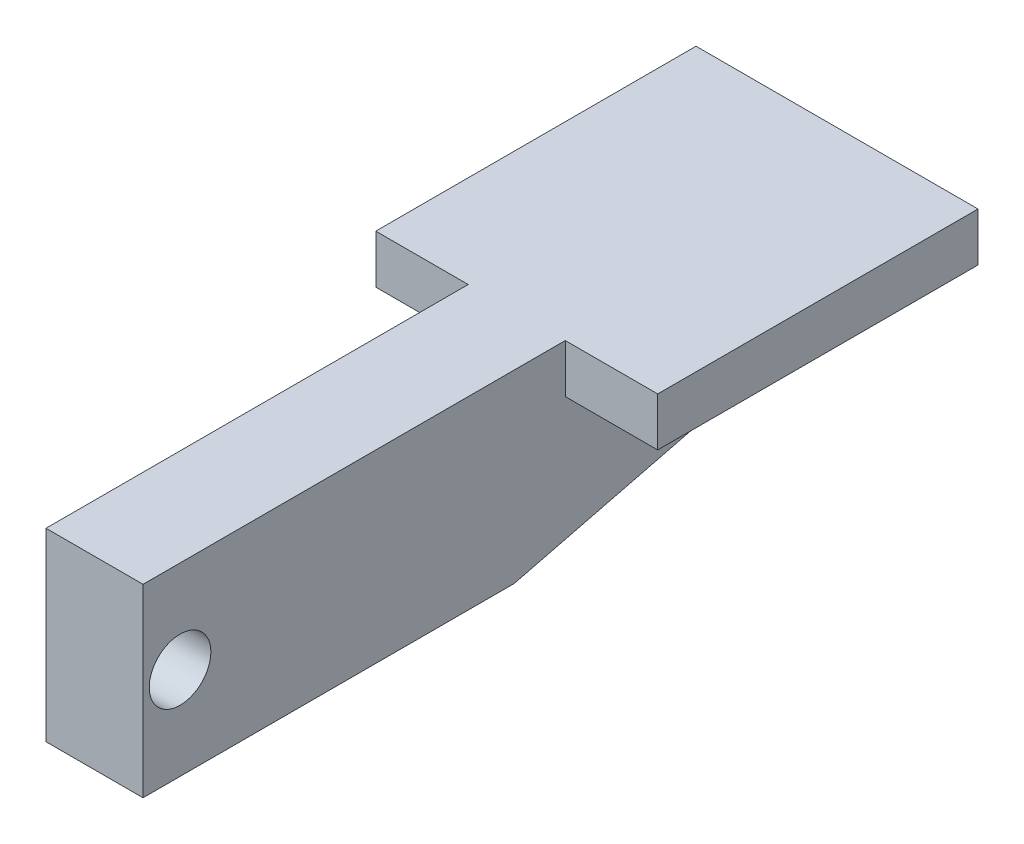
ISO-10303-21;
HEADER;
FILE_DESCRIPTION(('STEP AP214'),'2;1');
FILE_NAME('part.step','',(''),(''),'','','');
FILE_SCHEMA(('AUTOMOTIVE_DESIGN { 1 0 10303 214 1 1 1 1 }'));
ENDSEC;
DATA;
#1=APPLICATION_CONTEXT('core data for automotive mechanical design processes');
#2=APPLICATION_PROTOCOL_DEFINITION('international standard','automotive_design',2000,#1);
#3=PRODUCT_CONTEXT('',#1,'mechanical');
#4=PRODUCT('Part','Part','',(#3));
#5=PRODUCT_RELATED_PRODUCT_CATEGORY('part','',(#4));
#6=PRODUCT_DEFINITION_FORMATION('','',#4);
#7=PRODUCT_DEFINITION_CONTEXT('part definition',#1,'design');
#8=PRODUCT_DEFINITION('design','',#6,#7);
#9=PRODUCT_DEFINITION_SHAPE('','',#8);
#10=(LENGTH_UNIT() NAMED_UNIT(*) SI_UNIT(.MILLI.,.METRE.));
#11=(NAMED_UNIT(*) PLANE_ANGLE_UNIT() SI_UNIT($,.RADIAN.));
#12=(NAMED_UNIT(*) SI_UNIT($,.STERADIAN.) SOLID_ANGLE_UNIT());
#13=UNCERTAINTY_MEASURE_WITH_UNIT(LENGTH_MEASURE(1.E-05),#10,'distance_accuracy_value','');
#14=(GEOMETRIC_REPRESENTATION_CONTEXT(3) GLOBAL_UNCERTAINTY_ASSIGNED_CONTEXT((#13)) GLOBAL_UNIT_ASSIGNED_CONTEXT((#10,
#11,#12)) REPRESENTATION_CONTEXT('',''));
#15=CARTESIAN_POINT('',(0.,0.,0.));
#16=DIRECTION('',(0.,0.,1.));
#17=DIRECTION('',(1.,0.,0.));
#18=AXIS2_PLACEMENT_3D('',#15,#16,#17);
#19=CARTESIAN_POINT('',(0.,0.,0.));
#20=DIRECTION('',(1.,0.,0.));
#21=DIRECTION('',(0.,0.,-1.));
#22=AXIS2_PLACEMENT_3D('',#19,#20,#21);
#23=PLANE('',#22);
#24=CARTESIAN_POINT('',(0.,0.,68.88));
#25=DIRECTION('',(1.,0.,0.));
#26=DIRECTION('',(0.,0.,-1.));
#27=AXIS2_PLACEMENT_3D('',#24,#25,#26);
#28=CIRCLE('',#27,6.35);
#29=CARTESIAN_POINT('',(0.,0.,62.53));
#30=VERTEX_POINT('',#29);
#31=EDGE_CURVE('E230',#30,#30,#28,.T.);
#32=ORIENTED_EDGE('',*,*,#31,.T.);
#33=EDGE_LOOP('',(#32));
#34=FACE_BOUND('',#33,.T.);
#35=DIRECTION('',(0.,1.,0.));
#36=VECTOR('',#35,1.);
#37=CARTESIAN_POINT('',(0.,19.05,-10.5));
#38=LINE('',#37,#36);
#39=CARTESIAN_POINT('',(0.,9.05,-10.5));
#40=VERTEX_POINT('',#39);
#41=CARTESIAN_POINT('',(0.,19.05,-10.5));
#42=VERTEX_POINT('',#41);
#43=EDGE_CURVE('E147',#40,#42,#38,.T.);
#44=ORIENTED_EDGE('',*,*,#43,.F.);
#45=DIRECTION('',(0.,0.,1.));
#46=VECTOR('',#45,1.);
#47=CARTESIAN_POINT('',(0.,9.05,-76.5));
#48=LINE('',#47,#46);
#49=CARTESIAN_POINT('',(0.,9.05,-76.5));
#50=VERTEX_POINT('',#49);
#51=EDGE_CURVE('E61',#50,#40,#48,.T.);
#52=ORIENTED_EDGE('',*,*,#51,.F.);
#53=DIRECTION('',(0.,1.,0.));
#54=VECTOR('',#53,1.);
#55=CARTESIAN_POINT('',(0.,19.05,-76.5));
#56=LINE('',#55,#54);
#57=CARTESIAN_POINT('',(0.,1.11022302462516E-13,-76.5));
#58=VERTEX_POINT('',#57);
#59=EDGE_CURVE('E151',#58,#50,#56,.T.);
#60=ORIENTED_EDGE('',*,*,#59,.F.);
#61=DIRECTION('',(0.,0.241640143717287,-0.97036593146312));
#62=VECTOR('',#61,1.);
#63=CARTESIAN_POINT('',(0.,-19.05,0.));
#64=LINE('',#63,#62);
#65=CARTESIAN_POINT('',(0.,-19.05,0.));
#66=VERTEX_POINT('',#65);
#67=EDGE_CURVE('E198',#66,#58,#64,.T.);
#68=ORIENTED_EDGE('',*,*,#67,.F.);
#69=DIRECTION('',(0.,0.,-1.));
#70=VECTOR('',#69,1.);
#71=CARTESIAN_POINT('',(0.,-19.05,76.5));
#72=LINE('',#71,#70);
#73=CARTESIAN_POINT('',(0.,-19.05,76.5));
#74=VERTEX_POINT('',#73);
#75=EDGE_CURVE('E196',#74,#66,#72,.T.);
#76=ORIENTED_EDGE('',*,*,#75,.F.);
#77=DIRECTION('',(0.,-1.,0.));
#78=VECTOR('',#77,1.);
#79=CARTESIAN_POINT('',(0.,19.05,76.5));
#80=LINE('',#79,#78);
#81=CARTESIAN_POINT('',(0.,19.05,76.5));
#82=VERTEX_POINT('',#81);
#83=EDGE_CURVE('E181',#82,#74,#80,.T.);
#84=ORIENTED_EDGE('',*,*,#83,.F.);
#85=DIRECTION('',(0.,0.,1.));
#86=VECTOR('',#85,1.);
#87=CARTESIAN_POINT('',(0.,19.05,76.5));
#88=LINE('',#87,#86);
#89=EDGE_CURVE('E67',#42,#82,#88,.T.);
#90=ORIENTED_EDGE('',*,*,#89,.F.);
#91=EDGE_LOOP('',(#44,#52,#60,#68,#76,#84,#90));
#92=FACE_BOUND('',#91,.T.);
#93=ADVANCED_FACE('F46',(#34,#92),#23,.F.);
#94=CARTESIAN_POINT('',(20.0000000000002,19.05,76.5));
#95=DIRECTION('',(0.,0.,-1.));
#96=DIRECTION('',(-1.,0.,0.));
#97=AXIS2_PLACEMENT_3D('',#94,#95,#96);
#98=PLANE('',#97);
#99=ORIENTED_EDGE('',*,*,#83,.T.);
#100=DIRECTION('',(-1.,0.,0.));
#101=VECTOR('',#100,1.);
#102=CARTESIAN_POINT('',(20.,-19.0500000000001,76.5));
#103=LINE('',#102,#101);
#104=CARTESIAN_POINT('',(20.,-19.0500000000001,76.5));
#105=VERTEX_POINT('',#104);
#106=EDGE_CURVE('E13',#105,#74,#103,.T.);
#107=ORIENTED_EDGE('',*,*,#106,.F.);
#108=DIRECTION('',(0.,-1.,0.));
#109=VECTOR('',#108,1.);
#110=CARTESIAN_POINT('',(20.0000000000002,19.05,76.5));
#111=LINE('',#110,#109);
#112=CARTESIAN_POINT('',(20.0000000000002,19.05,76.5));
#113=VERTEX_POINT('',#112);
#114=EDGE_CURVE('E182',#113,#105,#111,.T.);
#115=ORIENTED_EDGE('',*,*,#114,.F.);
#116=DIRECTION('',(-1.,0.,0.));
#117=VECTOR('',#116,1.);
#118=CARTESIAN_POINT('',(20.0000000000002,19.05,76.5));
#119=LINE('',#118,#117);
#120=EDGE_CURVE('E193',#113,#82,#119,.T.);
#121=ORIENTED_EDGE('',*,*,#120,.T.);
#122=EDGE_LOOP('',(#99,#107,#115,#121));
#123=FACE_BOUND('',#122,.T.);
#124=ADVANCED_FACE('F48',(#123),#98,.F.);
#125=CARTESIAN_POINT('',(20.,-19.0500000000001,76.5));
#126=DIRECTION('',(0.,1.,0.));
#127=DIRECTION('',(0.,0.,1.));
#128=AXIS2_PLACEMENT_3D('',#125,#126,#127);
#129=PLANE('',#128);
#130=ORIENTED_EDGE('',*,*,#75,.T.);
#131=DIRECTION('',(-1.,0.,0.));
#132=VECTOR('',#131,1.);
#133=CARTESIAN_POINT('',(20.,-19.05,0.));
#134=LINE('',#133,#132);
#135=CARTESIAN_POINT('',(20.,-19.05,0.));
#136=VERTEX_POINT('',#135);
#137=EDGE_CURVE('E54',#136,#66,#134,.T.);
#138=ORIENTED_EDGE('',*,*,#137,.F.);
#139=DIRECTION('',(0.,0.,-1.));
#140=VECTOR('',#139,1.);
#141=CARTESIAN_POINT('',(20.,-19.0500000000001,76.5));
#142=LINE('',#141,#140);
#143=EDGE_CURVE('E185',#105,#136,#142,.T.);
#144=ORIENTED_EDGE('',*,*,#143,.F.);
#145=ORIENTED_EDGE('',*,*,#106,.T.);
#146=EDGE_LOOP('',(#130,#138,#144,#145));
#147=FACE_BOUND('',#146,.T.);
#148=ADVANCED_FACE('F216',(#147),#129,.F.);
#149=CARTESIAN_POINT('',(20.,-19.05,0.));
#150=DIRECTION('',(0.,0.970365931463121,0.241640143717287));
#151=DIRECTION('',(0.,-0.241640143717287,0.970365931463121));
#152=AXIS2_PLACEMENT_3D('',#149,#150,#151);
#153=PLANE('',#152);
#154=ORIENTED_EDGE('',*,*,#67,.T.);
#155=DIRECTION('',(-1.,0.,0.));
#156=VECTOR('',#155,1.);
#157=CARTESIAN_POINT('',(20.,0.,-76.5));
#158=LINE('',#157,#156);
#159=CARTESIAN_POINT('',(20.,0.,-76.5));
#160=VERTEX_POINT('',#159);
#161=EDGE_CURVE('E206',#160,#58,#158,.T.);
#162=ORIENTED_EDGE('',*,*,#161,.F.);
#163=DIRECTION('',(0.,0.241640143717287,-0.97036593146312));
#164=VECTOR('',#163,1.);
#165=CARTESIAN_POINT('',(20.,-19.05,0.));
#166=LINE('',#165,#164);
#167=EDGE_CURVE('E187',#136,#160,#166,.T.);
#168=ORIENTED_EDGE('',*,*,#167,.F.);
#169=ORIENTED_EDGE('',*,*,#137,.T.);
#170=EDGE_LOOP('',(#154,#162,#168,#169));
#171=FACE_BOUND('',#170,.T.);
#172=ADVANCED_FACE('F212',(#171),#153,.F.);
#173=CARTESIAN_POINT('',(20.,19.05,-76.5));
#174=DIRECTION('',(0.,0.,1.));
#175=DIRECTION('',(1.,0.,0.));
#176=AXIS2_PLACEMENT_3D('',#173,#174,#175);
#177=PLANE('',#176);
#178=ORIENTED_EDGE('',*,*,#59,.T.);
#179=DIRECTION('',(1.,0.,0.));
#180=VECTOR('',#179,1.);
#181=CARTESIAN_POINT('',(-19.05,9.05,-76.5));
#182=LINE('',#181,#180);
#183=CARTESIAN_POINT('',(-19.05,9.05,-76.5));
#184=VERTEX_POINT('',#183);
#185=EDGE_CURVE('E133',#184,#50,#182,.T.);
#186=ORIENTED_EDGE('',*,*,#185,.F.);
#187=DIRECTION('',(0.,-1.,0.));
#188=VECTOR('',#187,1.);
#189=CARTESIAN_POINT('',(-19.05,19.05,-76.5));
#190=LINE('',#189,#188);
#191=CARTESIAN_POINT('',(-19.05,19.05,-76.5));
#192=VERTEX_POINT('',#191);
#193=EDGE_CURVE('E139',#192,#184,#190,.T.);
#194=ORIENTED_EDGE('',*,*,#193,.F.);
#195=DIRECTION('',(-1.,0.,0.));
#196=VECTOR('',#195,1.);
#197=CARTESIAN_POINT('',(20.,19.05,-76.5));
#198=LINE('',#197,#196);
#199=CARTESIAN_POINT('',(39.05,19.05,-76.5));
#200=VERTEX_POINT('',#199);
#201=EDGE_CURVE('E204',#200,#192,#198,.T.);
#202=ORIENTED_EDGE('',*,*,#201,.F.);
#203=DIRECTION('',(0.,1.,0.));
#204=VECTOR('',#203,1.);
#205=CARTESIAN_POINT('',(39.05,19.05,-76.5));
#206=LINE('',#205,#204);
#207=CARTESIAN_POINT('',(39.05,9.04999999999995,-76.5000000000001));
#208=VERTEX_POINT('',#207);
#209=EDGE_CURVE('E161',#208,#200,#206,.T.);
#210=ORIENTED_EDGE('',*,*,#209,.F.);
#211=DIRECTION('',(-1.,0.,0.));
#212=VECTOR('',#211,1.);
#213=CARTESIAN_POINT('',(39.05,9.04999999999995,-76.5000000000001));
#214=LINE('',#213,#212);
#215=CARTESIAN_POINT('',(20.,9.05,-76.5));
#216=VERTEX_POINT('',#215);
#217=EDGE_CURVE('E169',#208,#216,#214,.T.);
#218=ORIENTED_EDGE('',*,*,#217,.T.);
#219=DIRECTION('',(0.,1.,0.));
#220=VECTOR('',#219,1.);
#221=CARTESIAN_POINT('',(20.,19.05,-76.5));
#222=LINE('',#221,#220);
#223=EDGE_CURVE('E189',#160,#216,#222,.T.);
#224=ORIENTED_EDGE('',*,*,#223,.F.);
#225=ORIENTED_EDGE('',*,*,#161,.T.);
#226=EDGE_LOOP('',(#178,#186,#194,#202,#210,#218,#224,#225));
#227=FACE_BOUND('',#226,.T.);
#228=ADVANCED_FACE('F149',(#227),#177,.F.);
#229=CARTESIAN_POINT('',(20.0000000000002,19.05,76.5));
#230=DIRECTION('',(0.,-1.,0.));
#231=DIRECTION('',(0.,0.,-1.));
#232=AXIS2_PLACEMENT_3D('',#229,#230,#231);
#233=PLANE('',#232);
#234=ORIENTED_EDGE('',*,*,#201,.T.);
#235=DIRECTION('',(0.,0.,-1.));
#236=VECTOR('',#235,1.);
#237=CARTESIAN_POINT('',(-19.05,19.05,-76.5));
#238=LINE('',#237,#236);
#239=CARTESIAN_POINT('',(-19.05,19.05,-10.5));
#240=VERTEX_POINT('',#239);
#241=EDGE_CURVE('E145',#240,#192,#238,.T.);
#242=ORIENTED_EDGE('',*,*,#241,.F.);
#243=DIRECTION('',(1.,0.,0.));
#244=VECTOR('',#243,1.);
#245=CARTESIAN_POINT('',(-19.05,19.05,-10.5));
#246=LINE('',#245,#244);
#247=EDGE_CURVE('E157',#240,#42,#246,.T.);
#248=ORIENTED_EDGE('',*,*,#247,.T.);
#249=ORIENTED_EDGE('',*,*,#89,.T.);
#250=ORIENTED_EDGE('',*,*,#120,.F.);
#251=DIRECTION('',(0.,0.,1.));
#252=VECTOR('',#251,1.);
#253=CARTESIAN_POINT('',(20.0000000000002,19.05,76.5));
#254=LINE('',#253,#252);
#255=CARTESIAN_POINT('',(20.,19.05,-10.5));
#256=VERTEX_POINT('',#255);
#257=EDGE_CURVE('E191',#256,#113,#254,.T.);
#258=ORIENTED_EDGE('',*,*,#257,.F.);
#259=DIRECTION('',(-1.,0.,0.));
#260=VECTOR('',#259,1.);
#261=CARTESIAN_POINT('',(39.05,19.05,-10.5));
#262=LINE('',#261,#260);
#263=CARTESIAN_POINT('',(39.05,19.05,-10.5));
#264=VERTEX_POINT('',#263);
#265=EDGE_CURVE('E178',#264,#256,#262,.T.);
#266=ORIENTED_EDGE('',*,*,#265,.F.);
#267=DIRECTION('',(0.,0.,1.));
#268=VECTOR('',#267,1.);
#269=CARTESIAN_POINT('',(39.05,19.05,-76.5));
#270=LINE('',#269,#268);
#271=EDGE_CURVE('E164',#200,#264,#270,.T.);
#272=ORIENTED_EDGE('',*,*,#271,.F.);
#273=EDGE_LOOP('',(#234,#242,#248,#249,#250,#258,#266,#272));
#274=FACE_BOUND('',#273,.T.);
#275=ADVANCED_FACE('F222',(#274),#233,.F.);
#276=CARTESIAN_POINT('',(20.,0.,0.));
#277=DIRECTION('',(1.,0.,0.));
#278=DIRECTION('',(0.,0.,-1.));
#279=AXIS2_PLACEMENT_3D('',#276,#277,#278);
#280=PLANE('',#279);
#281=CARTESIAN_POINT('',(20.,0.,68.8800000000001));
#282=DIRECTION('',(1.,0.,0.));
#283=DIRECTION('',(0.,0.,-1.));
#284=AXIS2_PLACEMENT_3D('',#281,#282,#283);
#285=CIRCLE('',#284,6.35);
#286=CARTESIAN_POINT('',(20.,0.,62.5300000000001));
#287=VERTEX_POINT('',#286);
#288=EDGE_CURVE('E235',#287,#287,#285,.T.);
#289=ORIENTED_EDGE('',*,*,#288,.F.);
#290=EDGE_LOOP('',(#289));
#291=FACE_BOUND('',#290,.T.);
#292=DIRECTION('',(0.,0.,-1.));
#293=VECTOR('',#292,1.);
#294=CARTESIAN_POINT('',(20.,9.05,-76.5));
#295=LINE('',#294,#293);
#296=CARTESIAN_POINT('',(20.,9.05,-10.5));
#297=VERTEX_POINT('',#296);
#298=EDGE_CURVE('E155',#297,#216,#295,.T.);
#299=ORIENTED_EDGE('',*,*,#298,.F.);
#300=DIRECTION('',(0.,-1.,0.));
#301=VECTOR('',#300,1.);
#302=CARTESIAN_POINT('',(20.,19.05,-10.5));
#303=LINE('',#302,#301);
#304=EDGE_CURVE('E152',#256,#297,#303,.T.);
#305=ORIENTED_EDGE('',*,*,#304,.F.);
#306=ORIENTED_EDGE('',*,*,#257,.T.);
#307=ORIENTED_EDGE('',*,*,#114,.T.);
#308=ORIENTED_EDGE('',*,*,#143,.T.);
#309=ORIENTED_EDGE('',*,*,#167,.T.);
#310=ORIENTED_EDGE('',*,*,#223,.T.);
#311=EDGE_LOOP('',(#299,#305,#306,#307,#308,#309,#310));
#312=FACE_BOUND('',#311,.T.);
#313=ADVANCED_FACE('F242',(#291,#312),#280,.T.);
#314=CARTESIAN_POINT('',(39.05,19.05,-10.5));
#315=DIRECTION('',(0.,0.,-1.));
#316=DIRECTION('',(0.,1.,0.));
#317=AXIS2_PLACEMENT_3D('',#314,#315,#316);
#318=PLANE('',#317);
#319=ORIENTED_EDGE('',*,*,#304,.T.);
#320=DIRECTION('',(-1.,0.,0.));
#321=VECTOR('',#320,1.);
#322=CARTESIAN_POINT('',(39.05,9.05,-10.5));
#323=LINE('',#322,#321);
#324=CARTESIAN_POINT('',(39.05,9.05,-10.5));
#325=VERTEX_POINT('',#324);
#326=EDGE_CURVE('E175',#325,#297,#323,.T.);
#327=ORIENTED_EDGE('',*,*,#326,.F.);
#328=DIRECTION('',(0.,-1.,0.));
#329=VECTOR('',#328,1.);
#330=CARTESIAN_POINT('',(39.05,19.05,-10.5));
#331=LINE('',#330,#329);
#332=EDGE_CURVE('E166',#264,#325,#331,.T.);
#333=ORIENTED_EDGE('',*,*,#332,.F.);
#334=ORIENTED_EDGE('',*,*,#265,.T.);
#335=EDGE_LOOP('',(#319,#327,#333,#334));
#336=FACE_BOUND('',#335,.T.);
#337=ADVANCED_FACE('F245',(#336),#318,.F.);
#338=CARTESIAN_POINT('',(39.05,9.04999999999995,-76.5000000000001));
#339=DIRECTION('',(0.,1.,0.));
#340=DIRECTION('',(0.,0.,1.));
#341=AXIS2_PLACEMENT_3D('',#338,#339,#340);
#342=PLANE('',#341);
#343=ORIENTED_EDGE('',*,*,#298,.T.);
#344=ORIENTED_EDGE('',*,*,#217,.F.);
#345=DIRECTION('',(0.,0.,-1.));
#346=VECTOR('',#345,1.);
#347=CARTESIAN_POINT('',(39.05,9.04999999999995,-76.5000000000001));
#348=LINE('',#347,#346);
#349=EDGE_CURVE('E168',#325,#208,#348,.T.);
#350=ORIENTED_EDGE('',*,*,#349,.F.);
#351=ORIENTED_EDGE('',*,*,#326,.T.);
#352=EDGE_LOOP('',(#343,#344,#350,#351));
#353=FACE_BOUND('',#352,.T.);
#354=ADVANCED_FACE('F254',(#353),#342,.F.);
#355=CARTESIAN_POINT('',(39.05,0.,0.));
#356=DIRECTION('',(-1.,0.,0.));
#357=DIRECTION('',(0.,0.,1.));
#358=AXIS2_PLACEMENT_3D('',#355,#356,#357);
#359=PLANE('',#358);
#360=ORIENTED_EDGE('',*,*,#209,.T.);
#361=ORIENTED_EDGE('',*,*,#271,.T.);
#362=ORIENTED_EDGE('',*,*,#332,.T.);
#363=ORIENTED_EDGE('',*,*,#349,.T.);
#364=EDGE_LOOP('',(#360,#361,#362,#363));
#365=FACE_BOUND('',#364,.T.);
#366=ADVANCED_FACE('F257',(#365),#359,.F.);
#367=CARTESIAN_POINT('',(-19.05,9.05,-76.5));
#368=DIRECTION('',(0.,1.,0.));
#369=DIRECTION('',(0.,0.,1.));
#370=AXIS2_PLACEMENT_3D('',#367,#368,#369);
#371=PLANE('',#370);
#372=ORIENTED_EDGE('',*,*,#51,.T.);
#373=DIRECTION('',(1.,0.,0.));
#374=VECTOR('',#373,1.);
#375=CARTESIAN_POINT('',(-19.05,9.05,-10.5));
#376=LINE('',#375,#374);
#377=CARTESIAN_POINT('',(-19.05,9.05,-10.5));
#378=VERTEX_POINT('',#377);
#379=EDGE_CURVE('E135',#378,#40,#376,.T.);
#380=ORIENTED_EDGE('',*,*,#379,.F.);
#381=DIRECTION('',(0.,0.,1.));
#382=VECTOR('',#381,1.);
#383=CARTESIAN_POINT('',(-19.05,9.05,-76.5));
#384=LINE('',#383,#382);
#385=EDGE_CURVE('E129',#184,#378,#384,.T.);
#386=ORIENTED_EDGE('',*,*,#385,.F.);
#387=ORIENTED_EDGE('',*,*,#185,.T.);
#388=EDGE_LOOP('',(#372,#380,#386,#387));
#389=FACE_BOUND('',#388,.T.);
#390=ADVANCED_FACE('F131',(#389),#371,.F.);
#391=CARTESIAN_POINT('',(-19.05,19.05,-10.5));
#392=DIRECTION('',(0.,0.,-1.));
#393=DIRECTION('',(0.,1.,0.));
#394=AXIS2_PLACEMENT_3D('',#391,#392,#393);
#395=PLANE('',#394);
#396=ORIENTED_EDGE('',*,*,#43,.T.);
#397=ORIENTED_EDGE('',*,*,#247,.F.);
#398=DIRECTION('',(0.,1.,0.));
#399=VECTOR('',#398,1.);
#400=CARTESIAN_POINT('',(-19.05,19.05,-10.5));
#401=LINE('',#400,#399);
#402=EDGE_CURVE('E138',#378,#240,#401,.T.);
#403=ORIENTED_EDGE('',*,*,#402,.F.);
#404=ORIENTED_EDGE('',*,*,#379,.T.);
#405=EDGE_LOOP('',(#396,#397,#403,#404));
#406=FACE_BOUND('',#405,.T.);
#407=ADVANCED_FACE('F265',(#406),#395,.F.);
#408=CARTESIAN_POINT('',(-19.05,0.,0.));
#409=DIRECTION('',(-1.,0.,0.));
#410=DIRECTION('',(0.,0.,1.));
#411=AXIS2_PLACEMENT_3D('',#408,#409,#410);
#412=PLANE('',#411);
#413=ORIENTED_EDGE('',*,*,#193,.T.);
#414=ORIENTED_EDGE('',*,*,#385,.T.);
#415=ORIENTED_EDGE('',*,*,#402,.T.);
#416=ORIENTED_EDGE('',*,*,#241,.T.);
#417=EDGE_LOOP('',(#413,#414,#415,#416));
#418=FACE_BOUND('',#417,.T.);
#419=ADVANCED_FACE('F143',(#418),#412,.T.);
#420=CARTESIAN_POINT('',(-19.05,0.,68.88));
#421=DIRECTION('',(1.,0.,0.));
#422=DIRECTION('',(0.,0.,-1.));
#423=AXIS2_PLACEMENT_3D('',#420,#421,#422);
#424=CYLINDRICAL_SURFACE('',#423,6.35);
#425=ORIENTED_EDGE('',*,*,#288,.T.);
#426=EDGE_LOOP('',(#425));
#427=FACE_BOUND('',#426,.T.);
#428=ORIENTED_EDGE('',*,*,#31,.F.);
#429=EDGE_LOOP('',(#428));
#430=FACE_BOUND('',#429,.T.);
#431=ADVANCED_FACE('F239',(#427,#430),#424,.F.);
#432=CLOSED_SHELL('',(#93,#124,#148,#172,#228,#275,#313,#337,#354,#366,#390,#407,#419,#431));
#433=MANIFOLD_SOLID_BREP('B2',#432);
#434=ADVANCED_BREP_SHAPE_REPRESENTATION('',(#18,#433),#14);
#435=SHAPE_DEFINITION_REPRESENTATION(#9,#434);
ENDSEC;
END-ISO-10303-21;
